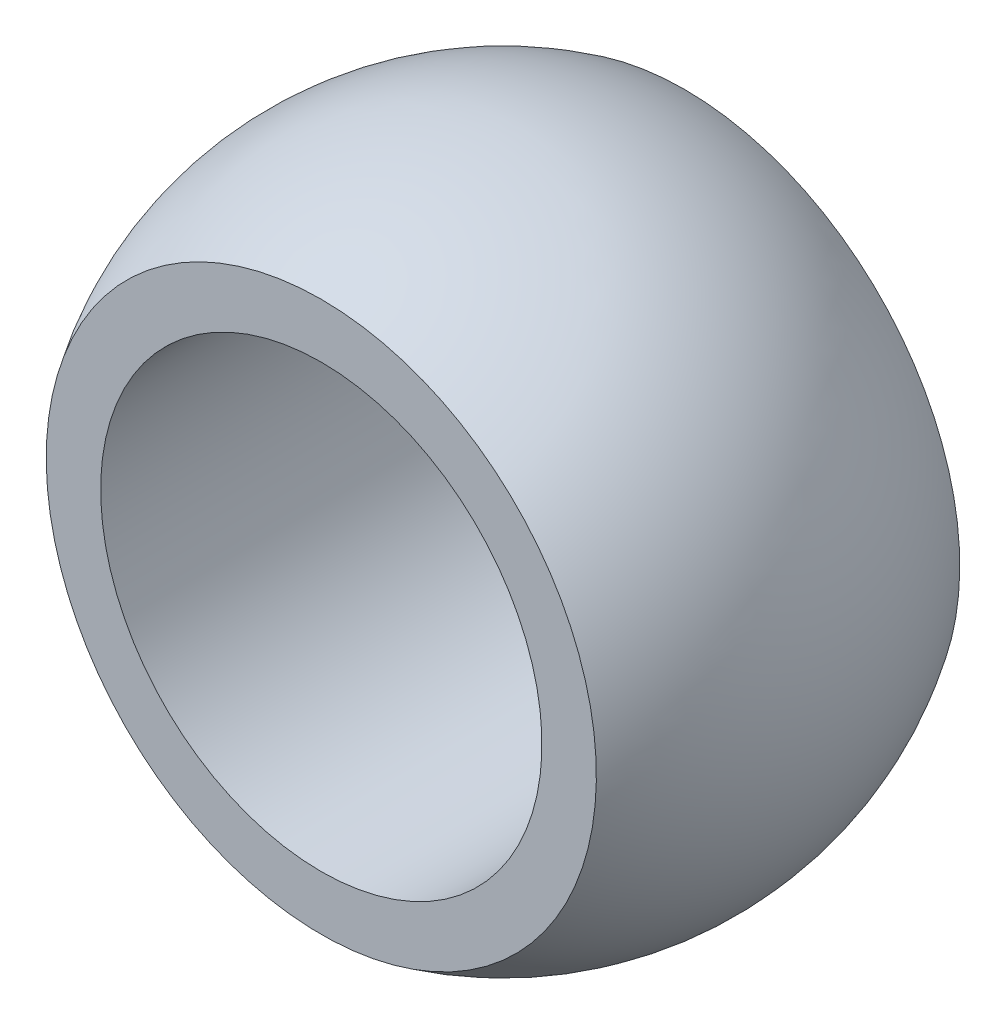
ISO-10303-21;
HEADER;
FILE_DESCRIPTION(('STEP AP214'),'2;1');
FILE_NAME('part.step','',(''),(''),'','','');
FILE_SCHEMA(('AUTOMOTIVE_DESIGN { 1 0 10303 214 1 1 1 1 }'));
ENDSEC;
DATA;
#1=APPLICATION_CONTEXT('core data for automotive mechanical design processes');
#2=APPLICATION_PROTOCOL_DEFINITION('international standard','automotive_design',2000,#1);
#3=PRODUCT_CONTEXT('',#1,'mechanical');
#4=PRODUCT('Part','Part','',(#3));
#5=PRODUCT_RELATED_PRODUCT_CATEGORY('part','',(#4));
#6=PRODUCT_DEFINITION_FORMATION('','',#4);
#7=PRODUCT_DEFINITION_CONTEXT('part definition',#1,'design');
#8=PRODUCT_DEFINITION('design','',#6,#7);
#9=PRODUCT_DEFINITION_SHAPE('','',#8);
#10=(LENGTH_UNIT() NAMED_UNIT(*) SI_UNIT(.MILLI.,.METRE.));
#11=(NAMED_UNIT(*) PLANE_ANGLE_UNIT() SI_UNIT($,.RADIAN.));
#12=(NAMED_UNIT(*) SI_UNIT($,.STERADIAN.) SOLID_ANGLE_UNIT());
#13=UNCERTAINTY_MEASURE_WITH_UNIT(LENGTH_MEASURE(1.E-05),#10,'distance_accuracy_value','');
#14=(GEOMETRIC_REPRESENTATION_CONTEXT(3) GLOBAL_UNCERTAINTY_ASSIGNED_CONTEXT((#13)) GLOBAL_UNIT_ASSIGNED_CONTEXT((#10,
#11,#12)) REPRESENTATION_CONTEXT('',''));
#15=CARTESIAN_POINT('',(0.,0.,0.));
#16=DIRECTION('',(0.,0.,1.));
#17=DIRECTION('',(1.,0.,0.));
#18=AXIS2_PLACEMENT_3D('',#15,#16,#17);
#19=CARTESIAN_POINT('',(0.,8.5,-7.));
#20=DIRECTION('',(0.,0.,-1.));
#21=DIRECTION('',(0.,1.,0.));
#22=AXIS2_PLACEMENT_3D('',#19,#20,#21);
#23=PLANE('',#22);
#24=CARTESIAN_POINT('',(0.,0.,-7.));
#25=DIRECTION('',(0.,0.,-1.));
#26=DIRECTION('',(0.,1.,0.));
#27=AXIS2_PLACEMENT_3D('',#24,#25,#26);
#28=CIRCLE('',#27,10.5966975987805);
#29=CARTESIAN_POINT('',(0.,10.5966975987805,-7.));
#30=VERTEX_POINT('',#29);
#31=EDGE_CURVE('E10',#30,#30,#28,.T.);
#32=ORIENTED_EDGE('',*,*,#31,.T.);
#33=EDGE_LOOP('',(#32));
#34=FACE_BOUND('',#33,.T.);
#35=CARTESIAN_POINT('',(0.,0.,-7.));
#36=DIRECTION('',(0.,0.,-1.));
#37=DIRECTION('',(0.,1.,0.));
#38=AXIS2_PLACEMENT_3D('',#35,#36,#37);
#39=CIRCLE('',#38,8.49999999999999);
#40=CARTESIAN_POINT('',(0.,8.49999999999999,-7.));
#41=VERTEX_POINT('',#40);
#42=EDGE_CURVE('E47',#41,#41,#39,.T.);
#43=ORIENTED_EDGE('',*,*,#42,.F.);
#44=EDGE_LOOP('',(#43));
#45=FACE_BOUND('',#44,.T.);
#46=ADVANCED_FACE('F33',(#34,#45),#23,.T.);
#47=CARTESIAN_POINT('',(0.,0.,0.));
#48=DIRECTION('',(0.,0.,-1.));
#49=DIRECTION('',(0.,1.,0.));
#50=AXIS2_PLACEMENT_3D('',#47,#48,#49);
#51=SPHERICAL_SURFACE('',#50,12.7);
#52=CARTESIAN_POINT('',(0.,0.,7.));
#53=DIRECTION('',(0.,0.,-1.));
#54=DIRECTION('',(0.,1.,0.));
#55=AXIS2_PLACEMENT_3D('',#52,#53,#54);
#56=CIRCLE('',#55,10.5966975987805);
#57=CARTESIAN_POINT('',(0.,10.5966975987805,7.));
#58=VERTEX_POINT('',#57);
#59=EDGE_CURVE('E39',#58,#58,#56,.T.);
#60=ORIENTED_EDGE('',*,*,#59,.T.);
#61=EDGE_LOOP('',(#60));
#62=FACE_BOUND('',#61,.T.);
#63=ORIENTED_EDGE('',*,*,#31,.F.);
#64=EDGE_LOOP('',(#63));
#65=FACE_BOUND('',#64,.T.);
#66=ADVANCED_FACE('F57',(#62,#65),#51,.T.);
#67=CARTESIAN_POINT('',(0.,8.5,7.));
#68=DIRECTION('',(0.,0.,1.));
#69=DIRECTION('',(0.,-1.,0.));
#70=AXIS2_PLACEMENT_3D('',#67,#68,#69);
#71=PLANE('',#70);
#72=CARTESIAN_POINT('',(0.,0.,7.));
#73=DIRECTION('',(0.,0.,-1.));
#74=DIRECTION('',(0.,1.,0.));
#75=AXIS2_PLACEMENT_3D('',#72,#73,#74);
#76=CIRCLE('',#75,8.5);
#77=CARTESIAN_POINT('',(0.,8.5,7.));
#78=VERTEX_POINT('',#77);
#79=EDGE_CURVE('E43',#78,#78,#76,.T.);
#80=ORIENTED_EDGE('',*,*,#79,.T.);
#81=EDGE_LOOP('',(#80));
#82=FACE_BOUND('',#81,.T.);
#83=ORIENTED_EDGE('',*,*,#59,.F.);
#84=EDGE_LOOP('',(#83));
#85=FACE_BOUND('',#84,.T.);
#86=ADVANCED_FACE('F61',(#82,#85),#71,.T.);
#87=CARTESIAN_POINT('',(0.,0.,-9.5415533210569));
#88=DIRECTION('',(0.,0.,-1.));
#89=DIRECTION('',(0.,1.,0.));
#90=AXIS2_PLACEMENT_3D('',#87,#88,#89);
#91=CYLINDRICAL_SURFACE('',#90,8.5);
#92=ORIENTED_EDGE('',*,*,#42,.T.);
#93=EDGE_LOOP('',(#92));
#94=FACE_BOUND('',#93,.T.);
#95=ORIENTED_EDGE('',*,*,#79,.F.);
#96=EDGE_LOOP('',(#95));
#97=FACE_BOUND('',#96,.T.);
#98=ADVANCED_FACE('F53',(#94,#97),#91,.F.);
#99=CLOSED_SHELL('',(#46,#66,#86,#98));
#100=MANIFOLD_SOLID_BREP('B2',#99);
#101=ADVANCED_BREP_SHAPE_REPRESENTATION('',(#18,#100),#14);
#102=SHAPE_DEFINITION_REPRESENTATION(#9,#101);
ENDSEC;
END-ISO-10303-21;
